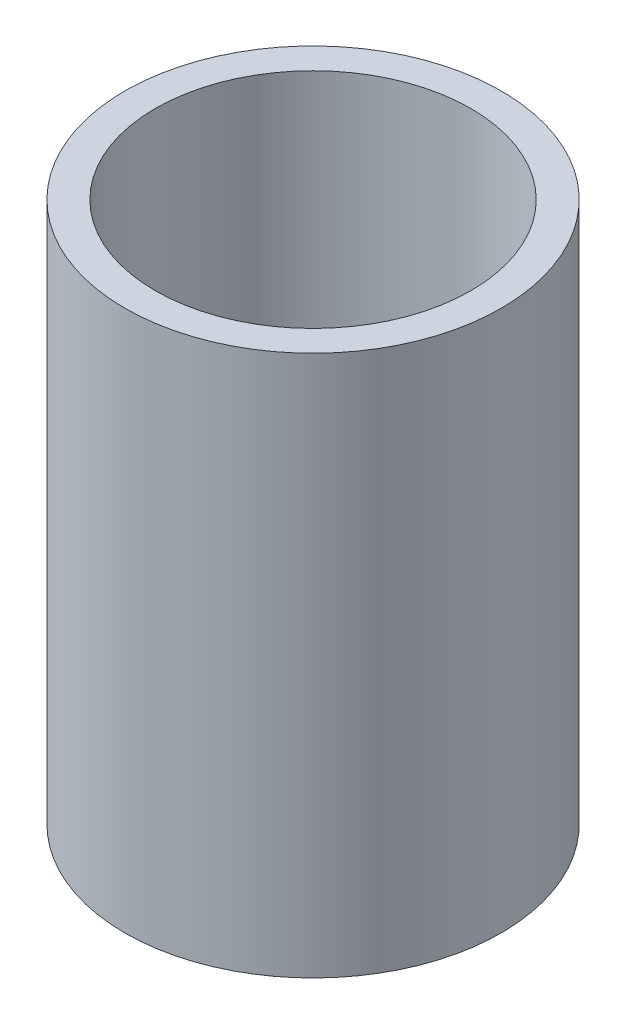
ISO-10303-21;
HEADER;
FILE_DESCRIPTION(('STEP AP214'),'2;1');
FILE_NAME('part.step','',(''),(''),'','','');
FILE_SCHEMA(('AUTOMOTIVE_DESIGN { 1 0 10303 214 1 1 1 1 }'));
ENDSEC;
DATA;
#1=APPLICATION_CONTEXT('core data for automotive mechanical design processes');
#2=APPLICATION_PROTOCOL_DEFINITION('international standard','automotive_design',2000,#1);
#3=PRODUCT_CONTEXT('',#1,'mechanical');
#4=PRODUCT('Part','Part','',(#3));
#5=PRODUCT_RELATED_PRODUCT_CATEGORY('part','',(#4));
#6=PRODUCT_DEFINITION_FORMATION('','',#4);
#7=PRODUCT_DEFINITION_CONTEXT('part definition',#1,'design');
#8=PRODUCT_DEFINITION('design','',#6,#7);
#9=PRODUCT_DEFINITION_SHAPE('','',#8);
#10=(LENGTH_UNIT() NAMED_UNIT(*) SI_UNIT(.MILLI.,.METRE.));
#11=(NAMED_UNIT(*) PLANE_ANGLE_UNIT() SI_UNIT($,.RADIAN.));
#12=(NAMED_UNIT(*) SI_UNIT($,.STERADIAN.) SOLID_ANGLE_UNIT());
#13=UNCERTAINTY_MEASURE_WITH_UNIT(LENGTH_MEASURE(1.E-05),#10,'distance_accuracy_value','');
#14=(GEOMETRIC_REPRESENTATION_CONTEXT(3) GLOBAL_UNCERTAINTY_ASSIGNED_CONTEXT((#13)) GLOBAL_UNIT_ASSIGNED_CONTEXT((#10,
#11,#12)) REPRESENTATION_CONTEXT('',''));
#15=CARTESIAN_POINT('',(0.,0.,0.));
#16=DIRECTION('',(0.,0.,1.));
#17=DIRECTION('',(1.,0.,0.));
#18=AXIS2_PLACEMENT_3D('',#15,#16,#17);
#19=CARTESIAN_POINT('',(0.,50.3108872986692,0.));
#20=DIRECTION('',(0.,-1.,0.));
#21=DIRECTION('',(0.,0.,-1.));
#22=AXIS2_PLACEMENT_3D('',#19,#20,#21);
#23=CYLINDRICAL_SURFACE('',#22,17.5);
#24=CARTESIAN_POINT('',(0.,50.3108872986692,0.));
#25=DIRECTION('',(0.,1.,0.));
#26=DIRECTION('',(0.,0.,1.));
#27=AXIS2_PLACEMENT_3D('',#24,#25,#26);
#28=CIRCLE('',#27,17.5);
#29=CARTESIAN_POINT('',(0.,50.3108872986692,17.5));
#30=VERTEX_POINT('',#29);
#31=EDGE_CURVE('E10',#30,#30,#28,.T.);
#32=ORIENTED_EDGE('',*,*,#31,.F.);
#33=EDGE_LOOP('',(#32));
#34=FACE_BOUND('',#33,.T.);
#35=CARTESIAN_POINT('',(0.,0.,0.));
#36=DIRECTION('',(0.,1.,0.));
#37=DIRECTION('',(0.,0.,1.));
#38=AXIS2_PLACEMENT_3D('',#35,#36,#37);
#39=CIRCLE('',#38,17.5);
#40=CARTESIAN_POINT('',(0.,0.,17.5));
#41=VERTEX_POINT('',#40);
#42=EDGE_CURVE('E37',#41,#41,#39,.T.);
#43=ORIENTED_EDGE('',*,*,#42,.T.);
#44=EDGE_LOOP('',(#43));
#45=FACE_BOUND('',#44,.T.);
#46=ADVANCED_FACE('F40',(#34,#45),#23,.T.);
#47=CARTESIAN_POINT('',(0.,50.3108872986692,0.));
#48=DIRECTION('',(0.,1.,0.));
#49=DIRECTION('',(0.,0.,1.));
#50=AXIS2_PLACEMENT_3D('',#47,#48,#49);
#51=PLANE('',#50);
#52=CARTESIAN_POINT('',(0.,50.3108872986692,0.));
#53=DIRECTION('',(0.,1.,0.));
#54=DIRECTION('',(0.,0.,1.));
#55=AXIS2_PLACEMENT_3D('',#52,#53,#54);
#56=CIRCLE('',#55,14.676112529018);
#57=CARTESIAN_POINT('',(0.,50.3108872986692,14.676112529018));
#58=VERTEX_POINT('',#57);
#59=EDGE_CURVE('E50',#58,#58,#56,.T.);
#60=ORIENTED_EDGE('',*,*,#59,.F.);
#61=EDGE_LOOP('',(#60));
#62=FACE_BOUND('',#61,.T.);
#63=ORIENTED_EDGE('',*,*,#31,.T.);
#64=EDGE_LOOP('',(#63));
#65=FACE_BOUND('',#64,.T.);
#66=ADVANCED_FACE('F59',(#62,#65),#51,.T.);
#67=CARTESIAN_POINT('',(0.,0.,0.));
#68=DIRECTION('',(0.,1.,0.));
#69=DIRECTION('',(0.,0.,1.));
#70=AXIS2_PLACEMENT_3D('',#67,#68,#69);
#71=PLANE('',#70);
#72=CARTESIAN_POINT('',(0.,0.,0.));
#73=DIRECTION('',(0.,1.,0.));
#74=DIRECTION('',(0.,0.,1.));
#75=AXIS2_PLACEMENT_3D('',#72,#73,#74);
#76=CIRCLE('',#75,14.676112529018);
#77=CARTESIAN_POINT('',(0.,0.,14.676112529018));
#78=VERTEX_POINT('',#77);
#79=EDGE_CURVE('E47',#78,#78,#76,.T.);
#80=ORIENTED_EDGE('',*,*,#79,.T.);
#81=EDGE_LOOP('',(#80));
#82=FACE_BOUND('',#81,.T.);
#83=ORIENTED_EDGE('',*,*,#42,.F.);
#84=EDGE_LOOP('',(#83));
#85=FACE_BOUND('',#84,.T.);
#86=ADVANCED_FACE('F58',(#82,#85),#71,.F.);
#87=CARTESIAN_POINT('',(0.,50.3108872986692,0.));
#88=DIRECTION('',(0.,-1.,0.));
#89=DIRECTION('',(0.,0.,-1.));
#90=AXIS2_PLACEMENT_3D('',#87,#88,#89);
#91=CYLINDRICAL_SURFACE('',#90,14.676112529018);
#92=ORIENTED_EDGE('',*,*,#59,.T.);
#93=EDGE_LOOP('',(#92));
#94=FACE_BOUND('',#93,.T.);
#95=ORIENTED_EDGE('',*,*,#79,.F.);
#96=EDGE_LOOP('',(#95));
#97=FACE_BOUND('',#96,.T.);
#98=ADVANCED_FACE('F54',(#94,#97),#91,.F.);
#99=CLOSED_SHELL('',(#46,#66,#86,#98));
#100=MANIFOLD_SOLID_BREP('B2',#99);
#101=ADVANCED_BREP_SHAPE_REPRESENTATION('',(#18,#100),#14);
#102=SHAPE_DEFINITION_REPRESENTATION(#9,#101);
ENDSEC;
END-ISO-10303-21;
